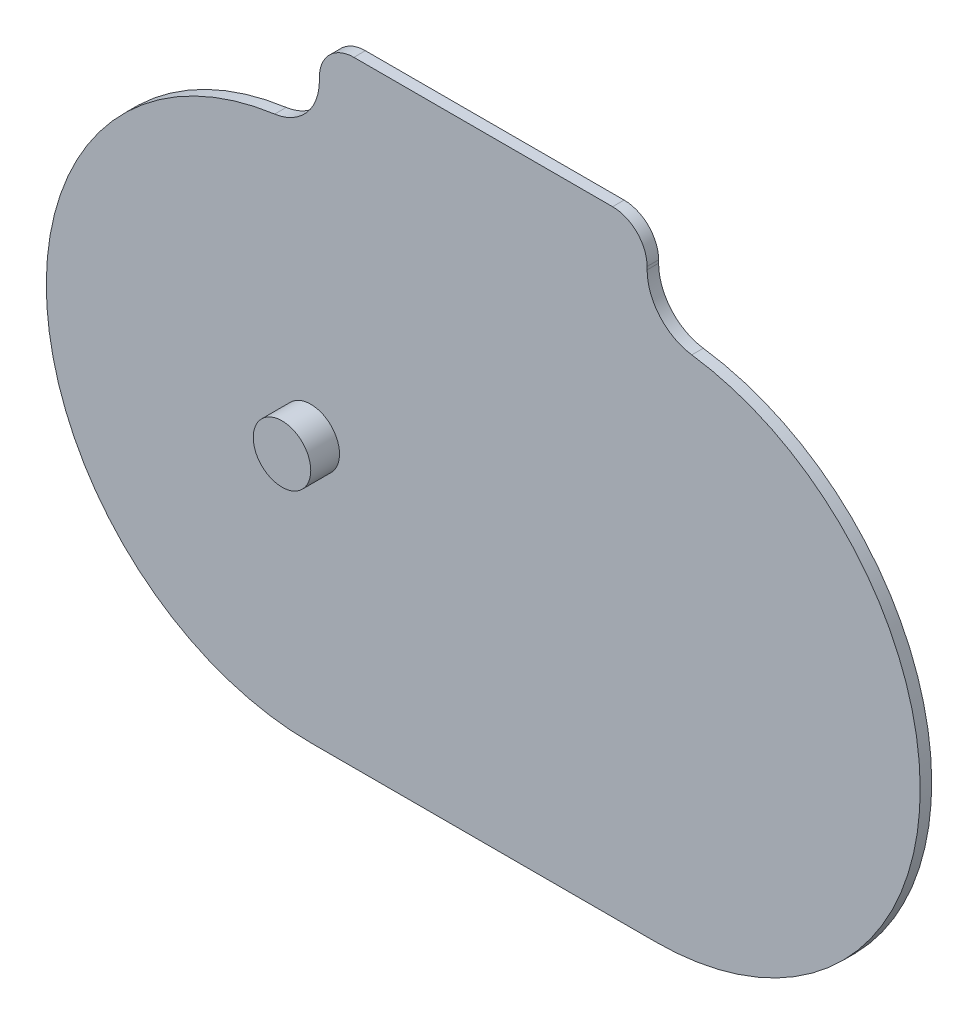
ISO-10303-21;
HEADER;
FILE_DESCRIPTION(('STEP AP214'),'2;1');
FILE_NAME('part.step','',(''),(''),'','','');
FILE_SCHEMA(('AUTOMOTIVE_DESIGN { 1 0 10303 214 1 1 1 1 }'));
ENDSEC;
DATA;
#1=APPLICATION_CONTEXT('core data for automotive mechanical design processes');
#2=APPLICATION_PROTOCOL_DEFINITION('international standard','automotive_design',2000,#1);
#3=PRODUCT_CONTEXT('',#1,'mechanical');
#4=PRODUCT('Part','Part','',(#3));
#5=PRODUCT_RELATED_PRODUCT_CATEGORY('part','',(#4));
#6=PRODUCT_DEFINITION_FORMATION('','',#4);
#7=PRODUCT_DEFINITION_CONTEXT('part definition',#1,'design');
#8=PRODUCT_DEFINITION('design','',#6,#7);
#9=PRODUCT_DEFINITION_SHAPE('','',#8);
#10=(LENGTH_UNIT() NAMED_UNIT(*) SI_UNIT(.MILLI.,.METRE.));
#11=(NAMED_UNIT(*) PLANE_ANGLE_UNIT() SI_UNIT($,.RADIAN.));
#12=(NAMED_UNIT(*) SI_UNIT($,.STERADIAN.) SOLID_ANGLE_UNIT());
#13=UNCERTAINTY_MEASURE_WITH_UNIT(LENGTH_MEASURE(1.E-05),#10,'distance_accuracy_value','');
#14=(GEOMETRIC_REPRESENTATION_CONTEXT(3) GLOBAL_UNCERTAINTY_ASSIGNED_CONTEXT((#13)) GLOBAL_UNIT_ASSIGNED_CONTEXT((#10,
#11,#12)) REPRESENTATION_CONTEXT('',''));
#15=CARTESIAN_POINT('',(0.,0.,0.));
#16=DIRECTION('',(0.,0.,1.));
#17=DIRECTION('',(1.,0.,0.));
#18=AXIS2_PLACEMENT_3D('',#15,#16,#17);
#19=CARTESIAN_POINT('',(37.5,54.4862367942584,2.));
#20=DIRECTION('',(0.,0.,-1.));
#21=DIRECTION('',(-1.,0.,0.));
#22=AXIS2_PLACEMENT_3D('',#19,#20,#21);
#23=CYLINDRICAL_SURFACE('',#22,9.);
#24=CARTESIAN_POINT('',(37.5,54.4862367942584,0.));
#25=DIRECTION('',(0.,0.,-1.));
#26=DIRECTION('',(1.,0.,0.));
#27=AXIS2_PLACEMENT_3D('',#24,#25,#26);
#28=CIRCLE('',#27,9.);
#29=CARTESIAN_POINT('',(36.2727272727273,45.5703071370161,0.));
#30=VERTEX_POINT('',#29);
#31=CARTESIAN_POINT('',(28.5,54.4862367942584,0.));
#32=VERTEX_POINT('',#31);
#33=EDGE_CURVE('E142',#30,#32,#28,.T.);
#34=ORIENTED_EDGE('',*,*,#33,.T.);
#35=DIRECTION('',(0.,0.,-1.));
#36=VECTOR('',#35,1.);
#37=CARTESIAN_POINT('',(28.5,54.4862367942584,2.));
#38=LINE('',#37,#36);
#39=CARTESIAN_POINT('',(28.5,54.4862367942584,2.));
#40=VERTEX_POINT('',#39);
#41=EDGE_CURVE('E41',#40,#32,#38,.T.);
#42=ORIENTED_EDGE('',*,*,#41,.F.);
#43=CARTESIAN_POINT('',(37.5,54.4862367942584,2.));
#44=DIRECTION('',(0.,0.,-1.));
#45=DIRECTION('',(1.,0.,0.));
#46=AXIS2_PLACEMENT_3D('',#43,#44,#45);
#47=CIRCLE('',#46,9.);
#48=CARTESIAN_POINT('',(36.2727272727273,45.5703071370161,2.));
#49=VERTEX_POINT('',#48);
#50=EDGE_CURVE('E161',#49,#40,#47,.T.);
#51=ORIENTED_EDGE('',*,*,#50,.F.);
#52=DIRECTION('',(0.,0.,-1.));
#53=VECTOR('',#52,1.);
#54=CARTESIAN_POINT('',(36.2727272727273,45.5703071370161,2.));
#55=LINE('',#54,#53);
#56=EDGE_CURVE('E138',#49,#30,#55,.T.);
#57=ORIENTED_EDGE('',*,*,#56,.T.);
#58=EDGE_LOOP('',(#34,#42,#51,#57));
#59=FACE_BOUND('',#58,.T.);
#60=ADVANCED_FACE('F33',(#59),#23,.F.);
#61=CARTESIAN_POINT('',(28.5,54.4862367942584,2.));
#62=DIRECTION('',(-1.,0.,0.));
#63=DIRECTION('',(0.,0.,1.));
#64=AXIS2_PLACEMENT_3D('',#61,#62,#63);
#65=PLANE('',#64);
#66=DIRECTION('',(0.,1.,0.));
#67=VECTOR('',#66,1.);
#68=CARTESIAN_POINT('',(28.5,54.4862367942584,0.));
#69=LINE('',#68,#67);
#70=CARTESIAN_POINT('',(28.5,54.9999999999999,0.));
#71=VERTEX_POINT('',#70);
#72=EDGE_CURVE('E145',#32,#71,#69,.T.);
#73=ORIENTED_EDGE('',*,*,#72,.T.);
#74=DIRECTION('',(0.,0.,-1.));
#75=VECTOR('',#74,1.);
#76=CARTESIAN_POINT('',(28.5,54.9999999999999,2.));
#77=LINE('',#76,#75);
#78=CARTESIAN_POINT('',(28.5,54.9999999999999,2.));
#79=VERTEX_POINT('',#78);
#80=EDGE_CURVE('E177',#79,#71,#77,.T.);
#81=ORIENTED_EDGE('',*,*,#80,.F.);
#82=DIRECTION('',(0.,1.,0.));
#83=VECTOR('',#82,1.);
#84=CARTESIAN_POINT('',(28.5,54.4862367942584,2.));
#85=LINE('',#84,#83);
#86=EDGE_CURVE('E99',#40,#79,#85,.T.);
#87=ORIENTED_EDGE('',*,*,#86,.F.);
#88=ORIENTED_EDGE('',*,*,#41,.T.);
#89=EDGE_LOOP('',(#73,#81,#87,#88));
#90=FACE_BOUND('',#89,.T.);
#91=ADVANCED_FACE('F180',(#90),#65,.F.);
#92=CARTESIAN_POINT('',(22.5,55.,2.));
#93=DIRECTION('',(0.,0.,-1.));
#94=DIRECTION('',(-1.,0.,0.));
#95=AXIS2_PLACEMENT_3D('',#92,#93,#94);
#96=CYLINDRICAL_SURFACE('',#95,6.);
#97=CARTESIAN_POINT('',(22.5,55.,0.));
#98=DIRECTION('',(0.,0.,1.));
#99=DIRECTION('',(1.,0.,0.));
#100=AXIS2_PLACEMENT_3D('',#97,#98,#99);
#101=CIRCLE('',#100,6.);
#102=CARTESIAN_POINT('',(22.5,61.,0.));
#103=VERTEX_POINT('',#102);
#104=EDGE_CURVE('E148',#71,#103,#101,.T.);
#105=ORIENTED_EDGE('',*,*,#104,.T.);
#106=DIRECTION('',(0.,0.,-1.));
#107=VECTOR('',#106,1.);
#108=CARTESIAN_POINT('',(22.5,61.,2.));
#109=LINE('',#108,#107);
#110=CARTESIAN_POINT('',(22.5,61.,2.));
#111=VERTEX_POINT('',#110);
#112=EDGE_CURVE('E174',#111,#103,#109,.T.);
#113=ORIENTED_EDGE('',*,*,#112,.F.);
#114=CARTESIAN_POINT('',(22.5,55.,2.));
#115=DIRECTION('',(0.,0.,1.));
#116=DIRECTION('',(1.,0.,0.));
#117=AXIS2_PLACEMENT_3D('',#114,#115,#116);
#118=CIRCLE('',#117,6.);
#119=EDGE_CURVE('E200',#79,#111,#118,.T.);
#120=ORIENTED_EDGE('',*,*,#119,.F.);
#121=ORIENTED_EDGE('',*,*,#80,.T.);
#122=EDGE_LOOP('',(#105,#113,#120,#121));
#123=FACE_BOUND('',#122,.T.);
#124=ADVANCED_FACE('F191',(#123),#96,.T.);
#125=CARTESIAN_POINT('',(22.5,61.,2.));
#126=DIRECTION('',(0.,-1.,0.));
#127=DIRECTION('',(0.,0.,-1.));
#128=AXIS2_PLACEMENT_3D('',#125,#126,#127);
#129=PLANE('',#128);
#130=DIRECTION('',(-1.,0.,0.));
#131=VECTOR('',#130,1.);
#132=CARTESIAN_POINT('',(22.5,61.,0.));
#133=LINE('',#132,#131);
#134=CARTESIAN_POINT('',(-22.5,61.,0.));
#135=VERTEX_POINT('',#134);
#136=EDGE_CURVE('E150',#103,#135,#133,.T.);
#137=ORIENTED_EDGE('',*,*,#136,.T.);
#138=DIRECTION('',(0.,0.,-1.));
#139=VECTOR('',#138,1.);
#140=CARTESIAN_POINT('',(-22.5,61.,2.));
#141=LINE('',#140,#139);
#142=CARTESIAN_POINT('',(-22.5,61.,2.));
#143=VERTEX_POINT('',#142);
#144=EDGE_CURVE('E171',#143,#135,#141,.T.);
#145=ORIENTED_EDGE('',*,*,#144,.F.);
#146=DIRECTION('',(-1.,0.,0.));
#147=VECTOR('',#146,1.);
#148=CARTESIAN_POINT('',(22.5,61.,2.));
#149=LINE('',#148,#147);
#150=EDGE_CURVE('E197',#111,#143,#149,.T.);
#151=ORIENTED_EDGE('',*,*,#150,.F.);
#152=ORIENTED_EDGE('',*,*,#112,.T.);
#153=EDGE_LOOP('',(#137,#145,#151,#152));
#154=FACE_BOUND('',#153,.T.);
#155=ADVANCED_FACE('F195',(#154),#129,.F.);
#156=CARTESIAN_POINT('',(-22.5,55.,2.));
#157=DIRECTION('',(0.,0.,-1.));
#158=DIRECTION('',(-1.,0.,0.));
#159=AXIS2_PLACEMENT_3D('',#156,#157,#158);
#160=CYLINDRICAL_SURFACE('',#159,6.);
#161=CARTESIAN_POINT('',(-22.5,55.,0.));
#162=DIRECTION('',(0.,0.,1.));
#163=DIRECTION('',(1.,0.,0.));
#164=AXIS2_PLACEMENT_3D('',#161,#162,#163);
#165=CIRCLE('',#164,6.);
#166=CARTESIAN_POINT('',(-28.5,55.,0.));
#167=VERTEX_POINT('',#166);
#168=EDGE_CURVE('E152',#135,#167,#165,.T.);
#169=ORIENTED_EDGE('',*,*,#168,.T.);
#170=DIRECTION('',(0.,0.,-1.));
#171=VECTOR('',#170,1.);
#172=CARTESIAN_POINT('',(-28.5,55.,2.));
#173=LINE('',#172,#171);
#174=CARTESIAN_POINT('',(-28.5,55.,2.));
#175=VERTEX_POINT('',#174);
#176=EDGE_CURVE('E168',#175,#167,#173,.T.);
#177=ORIENTED_EDGE('',*,*,#176,.F.);
#178=CARTESIAN_POINT('',(-22.5,55.,2.));
#179=DIRECTION('',(0.,0.,1.));
#180=DIRECTION('',(1.,0.,0.));
#181=AXIS2_PLACEMENT_3D('',#178,#179,#180);
#182=CIRCLE('',#181,6.);
#183=EDGE_CURVE('E199',#143,#175,#182,.T.);
#184=ORIENTED_EDGE('',*,*,#183,.F.);
#185=ORIENTED_EDGE('',*,*,#144,.T.);
#186=EDGE_LOOP('',(#169,#177,#184,#185));
#187=FACE_BOUND('',#186,.T.);
#188=ADVANCED_FACE('F217',(#187),#160,.T.);
#189=CARTESIAN_POINT('',(-28.5,55.,2.));
#190=DIRECTION('',(1.,0.,0.));
#191=DIRECTION('',(0.,0.,-1.));
#192=AXIS2_PLACEMENT_3D('',#189,#190,#191);
#193=PLANE('',#192);
#194=DIRECTION('',(0.,-1.,0.));
#195=VECTOR('',#194,1.);
#196=CARTESIAN_POINT('',(-28.5,55.,0.));
#197=LINE('',#196,#195);
#198=CARTESIAN_POINT('',(-28.5,54.4862367942584,0.));
#199=VERTEX_POINT('',#198);
#200=EDGE_CURVE('E154',#167,#199,#197,.T.);
#201=ORIENTED_EDGE('',*,*,#200,.T.);
#202=DIRECTION('',(0.,0.,-1.));
#203=VECTOR('',#202,1.);
#204=CARTESIAN_POINT('',(-28.5,54.4862367942584,2.));
#205=LINE('',#204,#203);
#206=CARTESIAN_POINT('',(-28.5,54.4862367942584,2.));
#207=VERTEX_POINT('',#206);
#208=EDGE_CURVE('E165',#207,#199,#205,.T.);
#209=ORIENTED_EDGE('',*,*,#208,.F.);
#210=DIRECTION('',(0.,-1.,0.));
#211=VECTOR('',#210,1.);
#212=CARTESIAN_POINT('',(-28.5,55.,2.));
#213=LINE('',#212,#211);
#214=EDGE_CURVE('E202',#175,#207,#213,.T.);
#215=ORIENTED_EDGE('',*,*,#214,.F.);
#216=ORIENTED_EDGE('',*,*,#176,.T.);
#217=EDGE_LOOP('',(#201,#209,#215,#216));
#218=FACE_BOUND('',#217,.T.);
#219=ADVANCED_FACE('F211',(#218),#193,.F.);
#220=CARTESIAN_POINT('',(-37.5,54.4862367942584,2.));
#221=DIRECTION('',(0.,0.,-1.));
#222=DIRECTION('',(-1.,0.,0.));
#223=AXIS2_PLACEMENT_3D('',#220,#221,#222);
#224=CYLINDRICAL_SURFACE('',#223,9.);
#225=CARTESIAN_POINT('',(-37.5,54.4862367942584,0.));
#226=DIRECTION('',(0.,0.,-1.));
#227=DIRECTION('',(1.,0.,0.));
#228=AXIS2_PLACEMENT_3D('',#225,#226,#227);
#229=CIRCLE('',#228,9.);
#230=CARTESIAN_POINT('',(-36.2727272727272,45.5703071370161,0.));
#231=VERTEX_POINT('',#230);
#232=EDGE_CURVE('E156',#199,#231,#229,.T.);
#233=ORIENTED_EDGE('',*,*,#232,.T.);
#234=DIRECTION('',(0.,0.,-1.));
#235=VECTOR('',#234,1.);
#236=CARTESIAN_POINT('',(-36.2727272727272,45.5703071370161,2.));
#237=LINE('',#236,#235);
#238=CARTESIAN_POINT('',(-36.2727272727272,45.5703071370161,2.));
#239=VERTEX_POINT('',#238);
#240=EDGE_CURVE('E133',#239,#231,#237,.T.);
#241=ORIENTED_EDGE('',*,*,#240,.F.);
#242=CARTESIAN_POINT('',(-37.5,54.4862367942584,2.));
#243=DIRECTION('',(0.,0.,-1.));
#244=DIRECTION('',(1.,0.,0.));
#245=AXIS2_PLACEMENT_3D('',#242,#243,#244);
#246=CIRCLE('',#245,9.);
#247=EDGE_CURVE('E124',#207,#239,#246,.T.);
#248=ORIENTED_EDGE('',*,*,#247,.F.);
#249=ORIENTED_EDGE('',*,*,#208,.T.);
#250=EDGE_LOOP('',(#233,#241,#248,#249));
#251=FACE_BOUND('',#250,.T.);
#252=ADVANCED_FACE('F215',(#251),#224,.F.);
#253=CARTESIAN_POINT('',(-30.,0.,2.));
#254=DIRECTION('',(0.,0.,-1.));
#255=DIRECTION('',(-1.,0.,0.));
#256=AXIS2_PLACEMENT_3D('',#253,#254,#255);
#257=CYLINDRICAL_SURFACE('',#256,46.);
#258=CARTESIAN_POINT('',(-30.,0.,0.));
#259=DIRECTION('',(0.,0.,1.));
#260=DIRECTION('',(1.,0.,0.));
#261=AXIS2_PLACEMENT_3D('',#258,#259,#260);
#262=CIRCLE('',#261,46.);
#263=CARTESIAN_POINT('',(-30.,-46.,0.));
#264=VERTEX_POINT('',#263);
#265=EDGE_CURVE('E132',#231,#264,#262,.T.);
#266=ORIENTED_EDGE('',*,*,#265,.T.);
#267=DIRECTION('',(0.,0.,-1.));
#268=VECTOR('',#267,1.);
#269=CARTESIAN_POINT('',(-30.,-46.,2.));
#270=LINE('',#269,#268);
#271=CARTESIAN_POINT('',(-30.,-46.,2.));
#272=VERTEX_POINT('',#271);
#273=EDGE_CURVE('E129',#272,#264,#270,.T.);
#274=ORIENTED_EDGE('',*,*,#273,.F.);
#275=CARTESIAN_POINT('',(-30.,0.,2.));
#276=DIRECTION('',(0.,0.,1.));
#277=DIRECTION('',(1.,0.,0.));
#278=AXIS2_PLACEMENT_3D('',#275,#276,#277);
#279=CIRCLE('',#278,46.);
#280=EDGE_CURVE('E118',#239,#272,#279,.T.);
#281=ORIENTED_EDGE('',*,*,#280,.F.);
#282=ORIENTED_EDGE('',*,*,#240,.T.);
#283=EDGE_LOOP('',(#266,#274,#281,#282));
#284=FACE_BOUND('',#283,.T.);
#285=ADVANCED_FACE('F130',(#284),#257,.T.);
#286=CARTESIAN_POINT('',(-30.,-46.,2.));
#287=DIRECTION('',(0.,1.,0.));
#288=DIRECTION('',(0.,0.,1.));
#289=AXIS2_PLACEMENT_3D('',#286,#287,#288);
#290=PLANE('',#289);
#291=DIRECTION('',(1.,0.,0.));
#292=VECTOR('',#291,1.);
#293=CARTESIAN_POINT('',(-30.,-46.,0.));
#294=LINE('',#293,#292);
#295=CARTESIAN_POINT('',(30.,-46.,0.));
#296=VERTEX_POINT('',#295);
#297=EDGE_CURVE('E84',#264,#296,#294,.T.);
#298=ORIENTED_EDGE('',*,*,#297,.T.);
#299=DIRECTION('',(0.,0.,-1.));
#300=VECTOR('',#299,1.);
#301=CARTESIAN_POINT('',(30.,-46.,2.));
#302=LINE('',#301,#300);
#303=CARTESIAN_POINT('',(30.,-46.,2.));
#304=VERTEX_POINT('',#303);
#305=EDGE_CURVE('E134',#304,#296,#302,.T.);
#306=ORIENTED_EDGE('',*,*,#305,.F.);
#307=DIRECTION('',(1.,0.,0.));
#308=VECTOR('',#307,1.);
#309=CARTESIAN_POINT('',(-30.,-46.,2.));
#310=LINE('',#309,#308);
#311=EDGE_CURVE('E122',#272,#304,#310,.T.);
#312=ORIENTED_EDGE('',*,*,#311,.F.);
#313=ORIENTED_EDGE('',*,*,#273,.T.);
#314=EDGE_LOOP('',(#298,#306,#312,#313));
#315=FACE_BOUND('',#314,.T.);
#316=ADVANCED_FACE('F136',(#315),#290,.F.);
#317=CARTESIAN_POINT('',(30.,0.,2.));
#318=DIRECTION('',(0.,0.,-1.));
#319=DIRECTION('',(-1.,0.,0.));
#320=AXIS2_PLACEMENT_3D('',#317,#318,#319);
#321=CYLINDRICAL_SURFACE('',#320,46.);
#322=CARTESIAN_POINT('',(30.,0.,0.));
#323=DIRECTION('',(0.,0.,1.));
#324=DIRECTION('',(1.,0.,0.));
#325=AXIS2_PLACEMENT_3D('',#322,#323,#324);
#326=CIRCLE('',#325,46.);
#327=EDGE_CURVE('E90',#296,#30,#326,.T.);
#328=ORIENTED_EDGE('',*,*,#327,.T.);
#329=ORIENTED_EDGE('',*,*,#56,.F.);
#330=CARTESIAN_POINT('',(30.,0.,2.));
#331=DIRECTION('',(0.,0.,1.));
#332=DIRECTION('',(1.,0.,0.));
#333=AXIS2_PLACEMENT_3D('',#330,#331,#332);
#334=CIRCLE('',#333,46.);
#335=EDGE_CURVE('E49',#304,#49,#334,.T.);
#336=ORIENTED_EDGE('',*,*,#335,.F.);
#337=ORIENTED_EDGE('',*,*,#305,.T.);
#338=EDGE_LOOP('',(#328,#329,#336,#337));
#339=FACE_BOUND('',#338,.T.);
#340=ADVANCED_FACE('F275',(#339),#321,.T.);
#341=CARTESIAN_POINT('',(37.5,54.4862367942584,2.));
#342=DIRECTION('',(0.,0.,1.));
#343=DIRECTION('',(1.,0.,0.));
#344=AXIS2_PLACEMENT_3D('',#341,#342,#343);
#345=PLANE('',#344);
#346=CARTESIAN_POINT('',(-30.,0.,2.));
#347=DIRECTION('',(0.,0.,1.));
#348=DIRECTION('',(1.,0.,0.));
#349=AXIS2_PLACEMENT_3D('',#346,#347,#348);
#350=CIRCLE('',#349,5.);
#351=CARTESIAN_POINT('',(-25.,0.,2.));
#352=VERTEX_POINT('',#351);
#353=EDGE_CURVE('E344',#352,#352,#350,.T.);
#354=ORIENTED_EDGE('',*,*,#353,.F.);
#355=EDGE_LOOP('',(#354));
#356=FACE_BOUND('',#355,.T.);
#357=ORIENTED_EDGE('',*,*,#50,.T.);
#358=ORIENTED_EDGE('',*,*,#86,.T.);
#359=ORIENTED_EDGE('',*,*,#119,.T.);
#360=ORIENTED_EDGE('',*,*,#150,.T.);
#361=ORIENTED_EDGE('',*,*,#183,.T.);
#362=ORIENTED_EDGE('',*,*,#214,.T.);
#363=ORIENTED_EDGE('',*,*,#247,.T.);
#364=ORIENTED_EDGE('',*,*,#280,.T.);
#365=ORIENTED_EDGE('',*,*,#311,.T.);
#366=ORIENTED_EDGE('',*,*,#335,.T.);
#367=EDGE_LOOP('',(#357,#358,#359,#360,#361,#362,#363,#364,#365,#366));
#368=FACE_BOUND('',#367,.T.);
#369=ADVANCED_FACE('F120',(#356,#368),#345,.T.);
#370=CARTESIAN_POINT('',(37.5,54.4862367942584,0.));
#371=DIRECTION('',(0.,0.,1.));
#372=DIRECTION('',(1.,0.,0.));
#373=AXIS2_PLACEMENT_3D('',#370,#371,#372);
#374=PLANE('',#373);
#375=CARTESIAN_POINT('',(30.,0.,0.));
#376=DIRECTION('',(0.,0.,1.));
#377=DIRECTION('',(1.,0.,0.));
#378=AXIS2_PLACEMENT_3D('',#375,#376,#377);
#379=CIRCLE('',#378,5.);
#380=CARTESIAN_POINT('',(35.,0.,0.));
#381=VERTEX_POINT('',#380);
#382=EDGE_CURVE('E11',#381,#381,#379,.F.);
#383=ORIENTED_EDGE('',*,*,#382,.F.);
#384=EDGE_LOOP('',(#383));
#385=FACE_BOUND('',#384,.T.);
#386=ORIENTED_EDGE('',*,*,#33,.F.);
#387=ORIENTED_EDGE('',*,*,#327,.F.);
#388=ORIENTED_EDGE('',*,*,#297,.F.);
#389=ORIENTED_EDGE('',*,*,#265,.F.);
#390=ORIENTED_EDGE('',*,*,#232,.F.);
#391=ORIENTED_EDGE('',*,*,#200,.F.);
#392=ORIENTED_EDGE('',*,*,#168,.F.);
#393=ORIENTED_EDGE('',*,*,#136,.F.);
#394=ORIENTED_EDGE('',*,*,#104,.F.);
#395=ORIENTED_EDGE('',*,*,#72,.F.);
#396=EDGE_LOOP('',(#386,#387,#388,#389,#390,#391,#392,#393,#394,#395));
#397=FACE_BOUND('',#396,.T.);
#398=ADVANCED_FACE('F185',(#385,#397),#374,.F.);
#399=CARTESIAN_POINT('',(-30.,0.,7.));
#400=DIRECTION('',(0.,0.,-1.));
#401=DIRECTION('',(-1.,0.,0.));
#402=AXIS2_PLACEMENT_3D('',#399,#400,#401);
#403=CYLINDRICAL_SURFACE('',#402,5.);
#404=CARTESIAN_POINT('',(-30.,0.,7.));
#405=DIRECTION('',(0.,0.,1.));
#406=DIRECTION('',(1.,0.,0.));
#407=AXIS2_PLACEMENT_3D('',#404,#405,#406);
#408=CIRCLE('',#407,5.);
#409=CARTESIAN_POINT('',(-25.,0.,7.));
#410=VERTEX_POINT('',#409);
#411=EDGE_CURVE('E146',#410,#410,#408,.T.);
#412=ORIENTED_EDGE('',*,*,#411,.F.);
#413=EDGE_LOOP('',(#412));
#414=FACE_BOUND('',#413,.T.);
#415=ORIENTED_EDGE('',*,*,#353,.T.);
#416=EDGE_LOOP('',(#415));
#417=FACE_BOUND('',#416,.T.);
#418=ADVANCED_FACE('F296',(#414,#417),#403,.T.);
#419=CARTESIAN_POINT('',(-30.,0.,7.));
#420=DIRECTION('',(0.,0.,1.));
#421=DIRECTION('',(1.,0.,0.));
#422=AXIS2_PLACEMENT_3D('',#419,#420,#421);
#423=PLANE('',#422);
#424=ORIENTED_EDGE('',*,*,#411,.T.);
#425=EDGE_LOOP('',(#424));
#426=FACE_BOUND('',#425,.T.);
#427=ADVANCED_FACE('F301',(#426),#423,.T.);
#428=CARTESIAN_POINT('',(30.,0.,-5.));
#429=DIRECTION('',(0.,0.,1.));
#430=DIRECTION('',(1.,0.,0.));
#431=AXIS2_PLACEMENT_3D('',#428,#429,#430);
#432=CYLINDRICAL_SURFACE('',#431,5.);
#433=CARTESIAN_POINT('',(30.,0.,-5.));
#434=DIRECTION('',(0.,0.,-1.));
#435=DIRECTION('',(-1.,0.,0.));
#436=AXIS2_PLACEMENT_3D('',#433,#434,#435);
#437=CIRCLE('',#436,5.);
#438=CARTESIAN_POINT('',(25.,0.,-5.));
#439=VERTEX_POINT('',#438);
#440=EDGE_CURVE('E343',#439,#439,#437,.T.);
#441=ORIENTED_EDGE('',*,*,#440,.F.);
#442=EDGE_LOOP('',(#441));
#443=FACE_BOUND('',#442,.T.);
#444=ORIENTED_EDGE('',*,*,#382,.T.);
#445=EDGE_LOOP('',(#444));
#446=FACE_BOUND('',#445,.T.);
#447=ADVANCED_FACE('F312',(#443,#446),#432,.T.);
#448=CARTESIAN_POINT('',(30.,0.,-5.));
#449=DIRECTION('',(0.,0.,-1.));
#450=DIRECTION('',(-1.,0.,0.));
#451=AXIS2_PLACEMENT_3D('',#448,#449,#450);
#452=PLANE('',#451);
#453=ORIENTED_EDGE('',*,*,#440,.T.);
#454=EDGE_LOOP('',(#453));
#455=FACE_BOUND('',#454,.T.);
#456=ADVANCED_FACE('F327',(#455),#452,.T.);
#457=CLOSED_SHELL('',(#60,#91,#124,#155,#188,#219,#252,#285,#316,#340,#369,#398,#418,#427,#447,#456));
#458=MANIFOLD_SOLID_BREP('B2',#457);
#459=ADVANCED_BREP_SHAPE_REPRESENTATION('',(#18,#458),#14);
#460=SHAPE_DEFINITION_REPRESENTATION(#9,#459);
ENDSEC;
END-ISO-10303-21;
